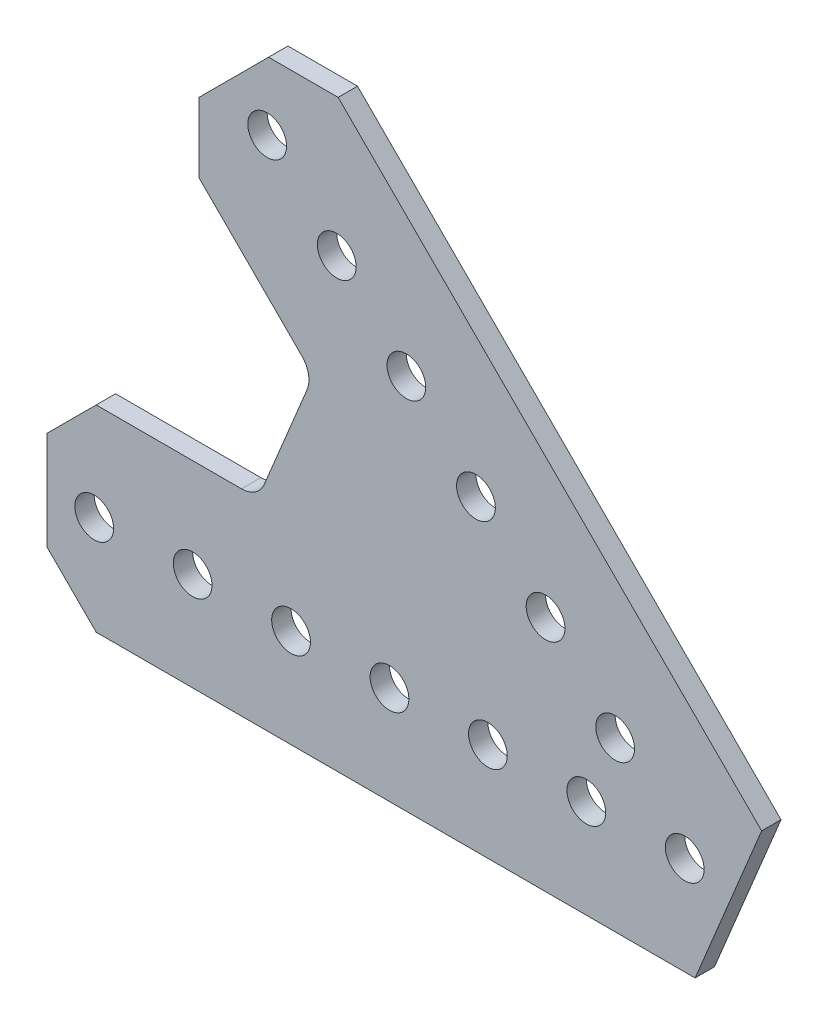
ISO-10303-21;
HEADER;
FILE_DESCRIPTION(('STEP AP214'),'2;1');
FILE_NAME('part.step','',(''),(''),'','','');
FILE_SCHEMA(('AUTOMOTIVE_DESIGN { 1 0 10303 214 1 1 1 1 }'));
ENDSEC;
DATA;
#1=APPLICATION_CONTEXT('core data for automotive mechanical design processes');
#2=APPLICATION_PROTOCOL_DEFINITION('international standard','automotive_design',2000,#1);
#3=PRODUCT_CONTEXT('',#1,'mechanical');
#4=PRODUCT('Part','Part','',(#3));
#5=PRODUCT_RELATED_PRODUCT_CATEGORY('part','',(#4));
#6=PRODUCT_DEFINITION_FORMATION('','',#4);
#7=PRODUCT_DEFINITION_CONTEXT('part definition',#1,'design');
#8=PRODUCT_DEFINITION('design','',#6,#7);
#9=PRODUCT_DEFINITION_SHAPE('','',#8);
#10=(LENGTH_UNIT() NAMED_UNIT(*) SI_UNIT(.MILLI.,.METRE.));
#11=(NAMED_UNIT(*) PLANE_ANGLE_UNIT() SI_UNIT($,.RADIAN.));
#12=(NAMED_UNIT(*) SI_UNIT($,.STERADIAN.) SOLID_ANGLE_UNIT());
#13=UNCERTAINTY_MEASURE_WITH_UNIT(LENGTH_MEASURE(1.E-05),#10,'distance_accuracy_value','');
#14=(GEOMETRIC_REPRESENTATION_CONTEXT(3) GLOBAL_UNCERTAINTY_ASSIGNED_CONTEXT((#13)) GLOBAL_UNIT_ASSIGNED_CONTEXT((#10,
#11,#12)) REPRESENTATION_CONTEXT('',''));
#15=CARTESIAN_POINT('',(0.,0.,0.));
#16=DIRECTION('',(0.,0.,1.));
#17=DIRECTION('',(1.,0.,0.));
#18=AXIS2_PLACEMENT_3D('',#15,#16,#17);
#19=CARTESIAN_POINT('',(9.92618864953346,8.03432359260485,1.25));
#20=DIRECTION('',(0.923879532511288,-0.382683432365087,0.));
#21=DIRECTION('',(0.382683432365087,0.923879532511288,0.));
#22=AXIS2_PLACEMENT_3D('',#19,#20,#21);
#23=PLANE('',#22);
#24=DIRECTION('',(-0.382683432365087,-0.923879532511288,0.));
#25=VECTOR('',#24,1.);
#26=CARTESIAN_POINT('',(9.92618864953346,8.03432359260485,-1.25));
#27=LINE('',#26,#25);
#28=CARTESIAN_POINT('',(9.92618864953346,8.03432359260485,-1.25));
#29=VERTEX_POINT('',#28);
#30=CARTESIAN_POINT('',(1.33775061084416,-12.7,-1.25));
#31=VERTEX_POINT('',#30);
#32=EDGE_CURVE('E184',#29,#31,#27,.T.);
#33=ORIENTED_EDGE('',*,*,#32,.F.);
#34=DIRECTION('',(0.,0.,-1.));
#35=VECTOR('',#34,1.);
#36=CARTESIAN_POINT('',(9.92618864953346,8.03432359260485,1.25));
#37=LINE('',#36,#35);
#38=CARTESIAN_POINT('',(9.92618864953346,8.03432359260485,1.25));
#39=VERTEX_POINT('',#38);
#40=EDGE_CURVE('E11',#39,#29,#37,.T.);
#41=ORIENTED_EDGE('',*,*,#40,.F.);
#42=DIRECTION('',(-0.382683432365087,-0.923879532511288,0.));
#43=VECTOR('',#42,1.);
#44=CARTESIAN_POINT('',(9.92618864953346,8.03432359260485,1.25));
#45=LINE('',#44,#43);
#46=CARTESIAN_POINT('',(1.33775061084416,-12.7,1.25));
#47=VERTEX_POINT('',#46);
#48=EDGE_CURVE('E237',#39,#47,#45,.T.);
#49=ORIENTED_EDGE('',*,*,#48,.T.);
#50=DIRECTION('',(0.,0.,-1.));
#51=VECTOR('',#50,1.);
#52=CARTESIAN_POINT('',(1.33775061084416,-12.7,1.25));
#53=LINE('',#52,#51);
#54=EDGE_CURVE('E48',#47,#31,#53,.T.);
#55=ORIENTED_EDGE('',*,*,#54,.T.);
#56=EDGE_LOOP('',(#33,#41,#49,#55));
#57=FACE_BOUND('',#56,.T.);
#58=ADVANCED_FACE('F45',(#57),#23,.T.);
#59=CARTESIAN_POINT('',(-44.7216754829247,62.6821877250624,1.25));
#60=DIRECTION('',(0.707106781186544,0.707106781186551,0.));
#61=DIRECTION('',(-0.707106781186551,0.707106781186544,0.));
#62=AXIS2_PLACEMENT_3D('',#59,#60,#61);
#63=PLANE('',#62);
#64=DIRECTION('',(0.707106781186551,-0.707106781186544,0.));
#65=VECTOR('',#64,1.);
#66=CARTESIAN_POINT('',(-44.7216754829247,62.6821877250624,-1.25));
#67=LINE('',#66,#65);
#68=CARTESIAN_POINT('',(-44.7216754829247,62.6821877250624,-1.25));
#69=VERTEX_POINT('',#68);
#70=EDGE_CURVE('E234',#69,#29,#67,.T.);
#71=ORIENTED_EDGE('',*,*,#70,.F.);
#72=DIRECTION('',(0.,0.,-1.));
#73=VECTOR('',#72,1.);
#74=CARTESIAN_POINT('',(-44.7216754829247,62.6821877250624,1.25));
#75=LINE('',#74,#73);
#76=CARTESIAN_POINT('',(-44.7216754829247,62.6821877250624,1.25));
#77=VERTEX_POINT('',#76);
#78=EDGE_CURVE('E55',#77,#69,#75,.T.);
#79=ORIENTED_EDGE('',*,*,#78,.F.);
#80=DIRECTION('',(0.707106781186551,-0.707106781186544,0.));
#81=VECTOR('',#80,1.);
#82=CARTESIAN_POINT('',(-44.7216754829247,62.6821877250624,1.25));
#83=LINE('',#82,#81);
#84=EDGE_CURVE('E170',#77,#39,#83,.T.);
#85=ORIENTED_EDGE('',*,*,#84,.T.);
#86=ORIENTED_EDGE('',*,*,#40,.T.);
#87=EDGE_LOOP('',(#71,#79,#85,#86));
#88=FACE_BOUND('',#87,.T.);
#89=ADVANCED_FACE('F273',(#88),#63,.T.);
#90=CARTESIAN_POINT('',(-53.7019316039937,62.6821877250624,1.25));
#91=DIRECTION('',(0.,1.,0.));
#92=DIRECTION('',(0.,0.,1.));
#93=AXIS2_PLACEMENT_3D('',#90,#91,#92);
#94=PLANE('',#93);
#95=DIRECTION('',(1.,0.,0.));
#96=VECTOR('',#95,1.);
#97=CARTESIAN_POINT('',(-53.7019316039937,62.6821877250624,-1.25));
#98=LINE('',#97,#96);
#99=CARTESIAN_POINT('',(-53.7019316039937,62.6821877250624,-1.25));
#100=VERTEX_POINT('',#99);
#101=EDGE_CURVE('E156',#100,#69,#98,.T.);
#102=ORIENTED_EDGE('',*,*,#101,.F.);
#103=DIRECTION('',(0.,0.,-1.));
#104=VECTOR('',#103,1.);
#105=CARTESIAN_POINT('',(-53.7019316039937,62.6821877250624,1.25));
#106=LINE('',#105,#104);
#107=CARTESIAN_POINT('',(-53.7019316039937,62.6821877250624,1.25));
#108=VERTEX_POINT('',#107);
#109=EDGE_CURVE('E151',#108,#100,#106,.T.);
#110=ORIENTED_EDGE('',*,*,#109,.F.);
#111=DIRECTION('',(1.,0.,0.));
#112=VECTOR('',#111,1.);
#113=CARTESIAN_POINT('',(-53.7019316039937,62.6821877250624,1.25));
#114=LINE('',#113,#112);
#115=EDGE_CURVE('E154',#108,#77,#114,.T.);
#116=ORIENTED_EDGE('',*,*,#115,.T.);
#117=ORIENTED_EDGE('',*,*,#78,.T.);
#118=EDGE_LOOP('',(#102,#110,#116,#117));
#119=FACE_BOUND('',#118,.T.);
#120=ADVANCED_FACE('F153',(#119),#94,.T.);
#121=CARTESIAN_POINT('',(-62.6821877250627,53.7019316039929,1.25));
#122=DIRECTION('',(-0.707106781186567,0.707106781186528,0.));
#123=DIRECTION('',(-0.707106781186528,-0.707106781186567,0.));
#124=AXIS2_PLACEMENT_3D('',#121,#122,#123);
#125=PLANE('',#124);
#126=DIRECTION('',(0.707106781186528,0.707106781186567,0.));
#127=VECTOR('',#126,1.);
#128=CARTESIAN_POINT('',(-62.6821877250627,53.7019316039929,-1.25));
#129=LINE('',#128,#127);
#130=CARTESIAN_POINT('',(-62.6821877250627,53.7019316039929,-1.25));
#131=VERTEX_POINT('',#130);
#132=EDGE_CURVE('E229',#131,#100,#129,.T.);
#133=ORIENTED_EDGE('',*,*,#132,.F.);
#134=DIRECTION('',(0.,0.,-1.));
#135=VECTOR('',#134,1.);
#136=CARTESIAN_POINT('',(-62.6821877250627,53.7019316039929,1.25));
#137=LINE('',#136,#135);
#138=CARTESIAN_POINT('',(-62.6821877250627,53.7019316039929,1.25));
#139=VERTEX_POINT('',#138);
#140=EDGE_CURVE('E162',#139,#131,#137,.T.);
#141=ORIENTED_EDGE('',*,*,#140,.F.);
#142=DIRECTION('',(0.707106781186528,0.707106781186567,0.));
#143=VECTOR('',#142,1.);
#144=CARTESIAN_POINT('',(-62.6821877250627,53.7019316039929,1.25));
#145=LINE('',#144,#143);
#146=EDGE_CURVE('E168',#139,#108,#145,.T.);
#147=ORIENTED_EDGE('',*,*,#146,.T.);
#148=ORIENTED_EDGE('',*,*,#109,.T.);
#149=EDGE_LOOP('',(#133,#141,#147,#148));
#150=FACE_BOUND('',#149,.T.);
#151=ADVANCED_FACE('F173',(#150),#125,.T.);
#152=CARTESIAN_POINT('',(-62.6821877250624,44.7216754829236,1.25));
#153=DIRECTION('',(-1.,0.,0.));
#154=DIRECTION('',(0.,-1.,0.));
#155=AXIS2_PLACEMENT_3D('',#152,#153,#154);
#156=PLANE('',#155);
#157=DIRECTION('',(0.,1.,0.));
#158=VECTOR('',#157,1.);
#159=CARTESIAN_POINT('',(-62.6821877250624,44.7216754829236,-1.25));
#160=LINE('',#159,#158);
#161=CARTESIAN_POINT('',(-62.6821877250624,44.7216754829236,-1.25));
#162=VERTEX_POINT('',#161);
#163=EDGE_CURVE('E225',#162,#131,#160,.T.);
#164=ORIENTED_EDGE('',*,*,#163,.F.);
#165=DIRECTION('',(0.,0.,-1.));
#166=VECTOR('',#165,1.);
#167=CARTESIAN_POINT('',(-62.6821877250624,44.7216754829236,1.25));
#168=LINE('',#167,#166);
#169=CARTESIAN_POINT('',(-62.6821877250624,44.7216754829236,1.25));
#170=VERTEX_POINT('',#169);
#171=EDGE_CURVE('E243',#170,#162,#168,.T.);
#172=ORIENTED_EDGE('',*,*,#171,.F.);
#173=DIRECTION('',(0.,1.,0.));
#174=VECTOR('',#173,1.);
#175=CARTESIAN_POINT('',(-62.6821877250624,44.7216754829236,1.25));
#176=LINE('',#175,#174);
#177=EDGE_CURVE('E175',#170,#139,#176,.T.);
#178=ORIENTED_EDGE('',*,*,#177,.T.);
#179=ORIENTED_EDGE('',*,*,#140,.T.);
#180=EDGE_LOOP('',(#164,#172,#178,#179));
#181=FACE_BOUND('',#180,.T.);
#182=ADVANCED_FACE('F286',(#181),#156,.T.);
#183=CARTESIAN_POINT('',(-49.4219589163473,31.4614466742085,1.25));
#184=DIRECTION('',(-0.707106781186545,-0.70710678118655,0.));
#185=DIRECTION('',(0.70710678118655,-0.707106781186545,0.));
#186=AXIS2_PLACEMENT_3D('',#183,#184,#185);
#187=PLANE('',#186);
#188=DIRECTION('',(-0.70710678118655,0.707106781186545,0.));
#189=VECTOR('',#188,1.);
#190=CARTESIAN_POINT('',(-49.4219589163473,31.4614466742085,-1.25));
#191=LINE('',#190,#189);
#192=CARTESIAN_POINT('',(-49.4219589163473,31.4614466742086,-1.25));
#193=VERTEX_POINT('',#192);
#194=EDGE_CURVE('E221',#193,#162,#191,.T.);
#195=ORIENTED_EDGE('',*,*,#194,.F.);
#196=DIRECTION('',(0.,0.,-1.));
#197=VECTOR('',#196,1.);
#198=CARTESIAN_POINT('',(-49.4219589163473,31.4614466742086,1.25));
#199=LINE('',#198,#197);
#200=CARTESIAN_POINT('',(-49.4219589163473,31.4614466742086,1.25));
#201=VERTEX_POINT('',#200);
#202=EDGE_CURVE('E246',#201,#193,#199,.T.);
#203=ORIENTED_EDGE('',*,*,#202,.F.);
#204=DIRECTION('',(-0.70710678118655,0.707106781186545,0.));
#205=VECTOR('',#204,1.);
#206=CARTESIAN_POINT('',(-49.4219589163473,31.4614466742085,1.25));
#207=LINE('',#206,#205);
#208=EDGE_CURVE('E178',#201,#170,#207,.T.);
#209=ORIENTED_EDGE('',*,*,#208,.T.);
#210=ORIENTED_EDGE('',*,*,#171,.T.);
#211=EDGE_LOOP('',(#195,#203,#209,#210));
#212=FACE_BOUND('',#211,.T.);
#213=ADVANCED_FACE('F289',(#212),#187,.T.);
#214=CARTESIAN_POINT('',(-51.6670229466146,29.2163826439413,1.25));
#215=DIRECTION('',(0.,0.,-1.));
#216=DIRECTION('',(-1.,0.,0.));
#217=AXIS2_PLACEMENT_3D('',#214,#215,#216);
#218=CYLINDRICAL_SURFACE('',#217,3.17500000000003);
#219=CARTESIAN_POINT('',(-51.6670229466146,29.2163826439413,-1.25));
#220=DIRECTION('',(0.,0.,1.));
#221=DIRECTION('',(1.,0.,0.));
#222=AXIS2_PLACEMENT_3D('',#219,#220,#221);
#223=CIRCLE('',#222,3.17500000000003);
#224=CARTESIAN_POINT('',(-48.7337054308912,28.0013627461821,-1.25));
#225=VERTEX_POINT('',#224);
#226=EDGE_CURVE('E217',#225,#193,#223,.T.);
#227=ORIENTED_EDGE('',*,*,#226,.F.);
#228=DIRECTION('',(0.,0.,-1.));
#229=VECTOR('',#228,1.);
#230=CARTESIAN_POINT('',(-48.7337054308912,28.0013627461821,1.25));
#231=LINE('',#230,#229);
#232=CARTESIAN_POINT('',(-48.7337054308912,28.0013627461821,1.25));
#233=VERTEX_POINT('',#232);
#234=EDGE_CURVE('E249',#233,#225,#231,.T.);
#235=ORIENTED_EDGE('',*,*,#234,.F.);
#236=CARTESIAN_POINT('',(-51.6670229466146,29.2163826439413,1.25));
#237=DIRECTION('',(0.,0.,1.));
#238=DIRECTION('',(1.,0.,0.));
#239=AXIS2_PLACEMENT_3D('',#236,#237,#238);
#240=CIRCLE('',#239,3.17500000000003);
#241=EDGE_CURVE('E521',#233,#201,#240,.T.);
#242=ORIENTED_EDGE('',*,*,#241,.T.);
#243=ORIENTED_EDGE('',*,*,#202,.T.);
#244=EDGE_LOOP('',(#227,#235,#242,#243));
#245=FACE_BOUND('',#244,.T.);
#246=ADVANCED_FACE('F293',(#245),#218,.F.);
#247=CARTESIAN_POINT('',(-54.2598870628207,14.6599801022408,1.25));
#248=DIRECTION('',(-0.923879532511287,0.38268343236509,0.));
#249=DIRECTION('',(-0.38268343236509,-0.923879532511287,0.));
#250=AXIS2_PLACEMENT_3D('',#247,#248,#249);
#251=PLANE('',#250);
#252=DIRECTION('',(0.38268343236509,0.923879532511287,0.));
#253=VECTOR('',#252,1.);
#254=CARTESIAN_POINT('',(-54.2598870628207,14.6599801022408,-1.25));
#255=LINE('',#254,#253);
#256=CARTESIAN_POINT('',(-54.2598870628207,14.6599801022408,-1.25));
#257=VERTEX_POINT('',#256);
#258=EDGE_CURVE('E213',#257,#225,#255,.T.);
#259=ORIENTED_EDGE('',*,*,#258,.F.);
#260=DIRECTION('',(0.,0.,-1.));
#261=VECTOR('',#260,1.);
#262=CARTESIAN_POINT('',(-54.2598870628207,14.6599801022408,1.25));
#263=LINE('',#262,#261);
#264=CARTESIAN_POINT('',(-54.2598870628207,14.6599801022408,1.25));
#265=VERTEX_POINT('',#264);
#266=EDGE_CURVE('E252',#265,#257,#263,.T.);
#267=ORIENTED_EDGE('',*,*,#266,.F.);
#268=DIRECTION('',(0.38268343236509,0.923879532511287,0.));
#269=VECTOR('',#268,1.);
#270=CARTESIAN_POINT('',(-54.2598870628207,14.6599801022408,1.25));
#271=LINE('',#270,#269);
#272=EDGE_CURVE('E517',#265,#233,#271,.T.);
#273=ORIENTED_EDGE('',*,*,#272,.T.);
#274=ORIENTED_EDGE('',*,*,#234,.T.);
#275=EDGE_LOOP('',(#259,#267,#273,#274));
#276=FACE_BOUND('',#275,.T.);
#277=ADVANCED_FACE('F297',(#276),#251,.T.);
#278=CARTESIAN_POINT('',(-57.193204578544,15.875,1.25));
#279=DIRECTION('',(0.,0.,-1.));
#280=DIRECTION('',(-1.,0.,0.));
#281=AXIS2_PLACEMENT_3D('',#278,#279,#280);
#282=CYLINDRICAL_SURFACE('',#281,3.17499999999998);
#283=CARTESIAN_POINT('',(-57.193204578544,15.875,-1.25));
#284=DIRECTION('',(0.,0.,1.));
#285=DIRECTION('',(1.,0.,0.));
#286=AXIS2_PLACEMENT_3D('',#283,#284,#285);
#287=CIRCLE('',#286,3.17499999999998);
#288=CARTESIAN_POINT('',(-57.193204578544,12.7,-1.25));
#289=VERTEX_POINT('',#288);
#290=EDGE_CURVE('E209',#289,#257,#287,.T.);
#291=ORIENTED_EDGE('',*,*,#290,.F.);
#292=DIRECTION('',(0.,0.,-1.));
#293=VECTOR('',#292,1.);
#294=CARTESIAN_POINT('',(-57.193204578544,12.7,1.25));
#295=LINE('',#294,#293);
#296=CARTESIAN_POINT('',(-57.193204578544,12.7,1.25));
#297=VERTEX_POINT('',#296);
#298=EDGE_CURVE('E255',#297,#289,#295,.T.);
#299=ORIENTED_EDGE('',*,*,#298,.F.);
#300=CARTESIAN_POINT('',(-57.193204578544,15.875,1.25));
#301=DIRECTION('',(0.,0.,1.));
#302=DIRECTION('',(1.,0.,0.));
#303=AXIS2_PLACEMENT_3D('',#300,#301,#302);
#304=CIRCLE('',#303,3.17499999999998);
#305=EDGE_CURVE('E513',#297,#265,#304,.T.);
#306=ORIENTED_EDGE('',*,*,#305,.T.);
#307=ORIENTED_EDGE('',*,*,#266,.T.);
#308=EDGE_LOOP('',(#291,#299,#306,#307));
#309=FACE_BOUND('',#308,.T.);
#310=ADVANCED_FACE('F301',(#309),#282,.F.);
#311=CARTESIAN_POINT('',(-75.946,12.7,1.25));
#312=DIRECTION('',(0.,1.,0.));
#313=DIRECTION('',(0.,0.,1.));
#314=AXIS2_PLACEMENT_3D('',#311,#312,#313);
#315=PLANE('',#314);
#316=DIRECTION('',(1.,0.,0.));
#317=VECTOR('',#316,1.);
#318=CARTESIAN_POINT('',(-75.946,12.7,-1.25));
#319=LINE('',#318,#317);
#320=CARTESIAN_POINT('',(-75.946,12.7,-1.25));
#321=VERTEX_POINT('',#320);
#322=EDGE_CURVE('E205',#321,#289,#319,.T.);
#323=ORIENTED_EDGE('',*,*,#322,.F.);
#324=DIRECTION('',(0.,0.,-1.));
#325=VECTOR('',#324,1.);
#326=CARTESIAN_POINT('',(-75.946,12.7,1.25));
#327=LINE('',#326,#325);
#328=CARTESIAN_POINT('',(-75.946,12.7,1.25));
#329=VERTEX_POINT('',#328);
#330=EDGE_CURVE('E258',#329,#321,#327,.T.);
#331=ORIENTED_EDGE('',*,*,#330,.F.);
#332=DIRECTION('',(1.,0.,0.));
#333=VECTOR('',#332,1.);
#334=CARTESIAN_POINT('',(-75.946,12.7,1.25));
#335=LINE('',#334,#333);
#336=EDGE_CURVE('E509',#329,#297,#335,.T.);
#337=ORIENTED_EDGE('',*,*,#336,.T.);
#338=ORIENTED_EDGE('',*,*,#298,.T.);
#339=EDGE_LOOP('',(#323,#331,#337,#338));
#340=FACE_BOUND('',#339,.T.);
#341=ADVANCED_FACE('F305',(#340),#315,.T.);
#342=CARTESIAN_POINT('',(-82.296,6.35,1.25));
#343=DIRECTION('',(-0.707106781186548,0.707106781186547,0.));
#344=DIRECTION('',(-0.707106781186547,-0.707106781186548,0.));
#345=AXIS2_PLACEMENT_3D('',#342,#343,#344);
#346=PLANE('',#345);
#347=DIRECTION('',(0.707106781186547,0.707106781186548,0.));
#348=VECTOR('',#347,1.);
#349=CARTESIAN_POINT('',(-82.296,6.35,-1.25));
#350=LINE('',#349,#348);
#351=CARTESIAN_POINT('',(-82.296,6.35,-1.25));
#352=VERTEX_POINT('',#351);
#353=EDGE_CURVE('E201',#352,#321,#350,.T.);
#354=ORIENTED_EDGE('',*,*,#353,.F.);
#355=DIRECTION('',(0.,0.,-1.));
#356=VECTOR('',#355,1.);
#357=CARTESIAN_POINT('',(-82.296,6.35,1.25));
#358=LINE('',#357,#356);
#359=CARTESIAN_POINT('',(-82.296,6.35,1.25));
#360=VERTEX_POINT('',#359);
#361=EDGE_CURVE('E261',#360,#352,#358,.T.);
#362=ORIENTED_EDGE('',*,*,#361,.F.);
#363=DIRECTION('',(0.707106781186547,0.707106781186548,0.));
#364=VECTOR('',#363,1.);
#365=CARTESIAN_POINT('',(-82.296,6.35,1.25));
#366=LINE('',#365,#364);
#367=EDGE_CURVE('E505',#360,#329,#366,.T.);
#368=ORIENTED_EDGE('',*,*,#367,.T.);
#369=ORIENTED_EDGE('',*,*,#330,.T.);
#370=EDGE_LOOP('',(#354,#362,#368,#369));
#371=FACE_BOUND('',#370,.T.);
#372=ADVANCED_FACE('F309',(#371),#346,.T.);
#373=CARTESIAN_POINT('',(-82.296,-6.35,1.25));
#374=DIRECTION('',(-1.,0.,0.));
#375=DIRECTION('',(0.,0.,1.));
#376=AXIS2_PLACEMENT_3D('',#373,#374,#375);
#377=PLANE('',#376);
#378=DIRECTION('',(0.,1.,0.));
#379=VECTOR('',#378,1.);
#380=CARTESIAN_POINT('',(-82.296,-6.35,-1.25));
#381=LINE('',#380,#379);
#382=CARTESIAN_POINT('',(-82.296,-6.35,-1.25));
#383=VERTEX_POINT('',#382);
#384=EDGE_CURVE('E197',#383,#352,#381,.T.);
#385=ORIENTED_EDGE('',*,*,#384,.F.);
#386=DIRECTION('',(0.,0.,-1.));
#387=VECTOR('',#386,1.);
#388=CARTESIAN_POINT('',(-82.296,-6.35,1.25));
#389=LINE('',#388,#387);
#390=CARTESIAN_POINT('',(-82.296,-6.35,1.25));
#391=VERTEX_POINT('',#390);
#392=EDGE_CURVE('E264',#391,#383,#389,.T.);
#393=ORIENTED_EDGE('',*,*,#392,.F.);
#394=DIRECTION('',(0.,1.,0.));
#395=VECTOR('',#394,1.);
#396=CARTESIAN_POINT('',(-82.296,-6.35,1.25));
#397=LINE('',#396,#395);
#398=EDGE_CURVE('E501',#391,#360,#397,.T.);
#399=ORIENTED_EDGE('',*,*,#398,.T.);
#400=ORIENTED_EDGE('',*,*,#361,.T.);
#401=EDGE_LOOP('',(#385,#393,#399,#400));
#402=FACE_BOUND('',#401,.T.);
#403=ADVANCED_FACE('F313',(#402),#377,.T.);
#404=CARTESIAN_POINT('',(-75.946,-12.7,1.25));
#405=DIRECTION('',(-0.707106781186548,-0.707106781186547,0.));
#406=DIRECTION('',(0.707106781186547,-0.707106781186548,0.));
#407=AXIS2_PLACEMENT_3D('',#404,#405,#406);
#408=PLANE('',#407);
#409=DIRECTION('',(-0.707106781186547,0.707106781186548,0.));
#410=VECTOR('',#409,1.);
#411=CARTESIAN_POINT('',(-75.946,-12.7,-1.25));
#412=LINE('',#411,#410);
#413=CARTESIAN_POINT('',(-75.946,-12.7,-1.25));
#414=VERTEX_POINT('',#413);
#415=EDGE_CURVE('E193',#414,#383,#412,.T.);
#416=ORIENTED_EDGE('',*,*,#415,.F.);
#417=DIRECTION('',(0.,0.,-1.));
#418=VECTOR('',#417,1.);
#419=CARTESIAN_POINT('',(-75.946,-12.7,1.25));
#420=LINE('',#419,#418);
#421=CARTESIAN_POINT('',(-75.946,-12.7,1.25));
#422=VERTEX_POINT('',#421);
#423=EDGE_CURVE('E266',#422,#414,#420,.T.);
#424=ORIENTED_EDGE('',*,*,#423,.F.);
#425=DIRECTION('',(-0.707106781186547,0.707106781186548,0.));
#426=VECTOR('',#425,1.);
#427=CARTESIAN_POINT('',(-75.946,-12.7,1.25));
#428=LINE('',#427,#426);
#429=EDGE_CURVE('E497',#422,#391,#428,.T.);
#430=ORIENTED_EDGE('',*,*,#429,.T.);
#431=ORIENTED_EDGE('',*,*,#392,.T.);
#432=EDGE_LOOP('',(#416,#424,#430,#431));
#433=FACE_BOUND('',#432,.T.);
#434=ADVANCED_FACE('F317',(#433),#408,.T.);
#435=CARTESIAN_POINT('',(1.33775061084416,-12.7,1.25));
#436=DIRECTION('',(0.,-1.,0.));
#437=DIRECTION('',(0.,0.,-1.));
#438=AXIS2_PLACEMENT_3D('',#435,#436,#437);
#439=PLANE('',#438);
#440=DIRECTION('',(-1.,0.,0.));
#441=VECTOR('',#440,1.);
#442=CARTESIAN_POINT('',(1.33775061084416,-12.7,-1.25));
#443=LINE('',#442,#441);
#444=EDGE_CURVE('E188',#31,#414,#443,.T.);
#445=ORIENTED_EDGE('',*,*,#444,.F.);
#446=ORIENTED_EDGE('',*,*,#54,.F.);
#447=DIRECTION('',(-1.,0.,0.));
#448=VECTOR('',#447,1.);
#449=CARTESIAN_POINT('',(1.33775061084416,-12.7,1.25));
#450=LINE('',#449,#448);
#451=EDGE_CURVE('E494',#47,#422,#450,.T.);
#452=ORIENTED_EDGE('',*,*,#451,.T.);
#453=ORIENTED_EDGE('',*,*,#423,.T.);
#454=EDGE_LOOP('',(#445,#446,#452,#453));
#455=FACE_BOUND('',#454,.T.);
#456=ADVANCED_FACE('F270',(#455),#439,.T.);
#457=CARTESIAN_POINT('',(-57.193204578544,15.875,1.25));
#458=DIRECTION('',(0.,0.,1.));
#459=DIRECTION('',(1.,0.,0.));
#460=AXIS2_PLACEMENT_3D('',#457,#458,#459);
#461=PLANE('',#460);
#462=CARTESIAN_POINT('',(-8.98025612106892,8.98025612106939,1.25));
#463=DIRECTION('',(0.,0.,-1.));
#464=DIRECTION('',(1.,0.,0.));
#465=AXIS2_PLACEMENT_3D('',#462,#463,#464);
#466=CIRCLE('',#465,2.5);
#467=CARTESIAN_POINT('',(-6.48025612106892,8.98025612106939,1.25));
#468=VERTEX_POINT('',#467);
#469=EDGE_CURVE('E388',#468,#468,#466,.T.);
#470=ORIENTED_EDGE('',*,*,#469,.T.);
#471=EDGE_LOOP('',(#470));
#472=FACE_BOUND('',#471,.T.);
#473=CARTESIAN_POINT('',(-17.9605122421381,17.9605122421385,1.25));
#474=DIRECTION('',(0.,0.,-1.));
#475=DIRECTION('',(1.,0.,0.));
#476=AXIS2_PLACEMENT_3D('',#473,#474,#475);
#477=CIRCLE('',#476,2.5);
#478=CARTESIAN_POINT('',(-15.4605122421381,17.9605122421385,1.25));
#479=VERTEX_POINT('',#478);
#480=EDGE_CURVE('E398',#479,#479,#477,.T.);
#481=ORIENTED_EDGE('',*,*,#480,.T.);
#482=EDGE_LOOP('',(#481));
#483=FACE_BOUND('',#482,.T.);
#484=CARTESIAN_POINT('',(-26.9407683632073,26.9407683632076,1.25));
#485=DIRECTION('',(0.,0.,-1.));
#486=DIRECTION('',(1.,0.,0.));
#487=AXIS2_PLACEMENT_3D('',#484,#485,#486);
#488=CIRCLE('',#487,2.5);
#489=CARTESIAN_POINT('',(-24.4407683632073,26.9407683632076,1.25));
#490=VERTEX_POINT('',#489);
#491=EDGE_CURVE('E406',#490,#490,#488,.T.);
#492=ORIENTED_EDGE('',*,*,#491,.T.);
#493=EDGE_LOOP('',(#492));
#494=FACE_BOUND('',#493,.T.);
#495=CARTESIAN_POINT('',(-35.9210244842765,35.9210244842767,1.25));
#496=DIRECTION('',(0.,0.,-1.));
#497=DIRECTION('',(1.,0.,0.));
#498=AXIS2_PLACEMENT_3D('',#495,#496,#497);
#499=CIRCLE('',#498,2.5);
#500=CARTESIAN_POINT('',(-33.4210244842765,35.9210244842767,1.25));
#501=VERTEX_POINT('',#500);
#502=EDGE_CURVE('E414',#501,#501,#499,.T.);
#503=ORIENTED_EDGE('',*,*,#502,.T.);
#504=EDGE_LOOP('',(#503));
#505=FACE_BOUND('',#504,.T.);
#506=CARTESIAN_POINT('',(-44.9012806053457,44.9012806053458,1.25));
#507=DIRECTION('',(0.,0.,-1.));
#508=DIRECTION('',(1.,0.,0.));
#509=AXIS2_PLACEMENT_3D('',#506,#507,#508);
#510=CIRCLE('',#509,2.5);
#511=CARTESIAN_POINT('',(-42.4012806053457,44.9012806053458,1.25));
#512=VERTEX_POINT('',#511);
#513=EDGE_CURVE('E422',#512,#512,#510,.T.);
#514=ORIENTED_EDGE('',*,*,#513,.T.);
#515=EDGE_LOOP('',(#514));
#516=FACE_BOUND('',#515,.T.);
#517=CARTESIAN_POINT('',(-53.8815367264149,53.8815367264149,1.25));
#518=DIRECTION('',(0.,0.,-1.));
#519=DIRECTION('',(1.,0.,0.));
#520=AXIS2_PLACEMENT_3D('',#517,#518,#519);
#521=CIRCLE('',#520,2.5);
#522=CARTESIAN_POINT('',(-51.3815367264149,53.8815367264149,1.25));
#523=VERTEX_POINT('',#522);
#524=EDGE_CURVE('E430',#523,#523,#521,.T.);
#525=ORIENTED_EDGE('',*,*,#524,.T.);
#526=EDGE_LOOP('',(#525));
#527=FACE_BOUND('',#526,.T.);
#528=CARTESIAN_POINT('',(-63.5,0.,1.25));
#529=DIRECTION('',(0.,0.,-1.));
#530=DIRECTION('',(1.,0.,0.));
#531=AXIS2_PLACEMENT_3D('',#528,#529,#530);
#532=CIRCLE('',#531,2.5);
#533=CARTESIAN_POINT('',(-61.,0.,1.25));
#534=VERTEX_POINT('',#533);
#535=EDGE_CURVE('E438',#534,#534,#532,.T.);
#536=ORIENTED_EDGE('',*,*,#535,.T.);
#537=EDGE_LOOP('',(#536));
#538=FACE_BOUND('',#537,.T.);
#539=CARTESIAN_POINT('',(-76.2,0.,1.25));
#540=DIRECTION('',(0.,0.,-1.));
#541=DIRECTION('',(1.,0.,0.));
#542=AXIS2_PLACEMENT_3D('',#539,#540,#541);
#543=CIRCLE('',#542,2.5);
#544=CARTESIAN_POINT('',(-73.7,0.,1.25));
#545=VERTEX_POINT('',#544);
#546=EDGE_CURVE('E446',#545,#545,#543,.T.);
#547=ORIENTED_EDGE('',*,*,#546,.T.);
#548=EDGE_LOOP('',(#547));
#549=FACE_BOUND('',#548,.T.);
#550=CARTESIAN_POINT('',(0.,0.,1.25));
#551=DIRECTION('',(0.,0.,-1.));
#552=DIRECTION('',(1.,0.,0.));
#553=AXIS2_PLACEMENT_3D('',#550,#551,#552);
#554=CIRCLE('',#553,2.5);
#555=CARTESIAN_POINT('',(2.5,0.,1.25));
#556=VERTEX_POINT('',#555);
#557=EDGE_CURVE('E454',#556,#556,#554,.T.);
#558=ORIENTED_EDGE('',*,*,#557,.T.);
#559=EDGE_LOOP('',(#558));
#560=FACE_BOUND('',#559,.T.);
#561=CARTESIAN_POINT('',(-50.8,0.,1.25));
#562=DIRECTION('',(0.,0.,-1.));
#563=DIRECTION('',(1.,0.,0.));
#564=AXIS2_PLACEMENT_3D('',#561,#562,#563);
#565=CIRCLE('',#564,2.5);
#566=CARTESIAN_POINT('',(-48.3,0.,1.25));
#567=VERTEX_POINT('',#566);
#568=EDGE_CURVE('E462',#567,#567,#565,.T.);
#569=ORIENTED_EDGE('',*,*,#568,.T.);
#570=EDGE_LOOP('',(#569));
#571=FACE_BOUND('',#570,.T.);
#572=CARTESIAN_POINT('',(-38.1,0.,1.25));
#573=DIRECTION('',(0.,0.,-1.));
#574=DIRECTION('',(1.,0.,0.));
#575=AXIS2_PLACEMENT_3D('',#572,#573,#574);
#576=CIRCLE('',#575,2.5);
#577=CARTESIAN_POINT('',(-35.6,0.,1.25));
#578=VERTEX_POINT('',#577);
#579=EDGE_CURVE('E470',#578,#578,#576,.T.);
#580=ORIENTED_EDGE('',*,*,#579,.T.);
#581=EDGE_LOOP('',(#580));
#582=FACE_BOUND('',#581,.T.);
#583=CARTESIAN_POINT('',(-25.4,0.,1.25));
#584=DIRECTION('',(0.,0.,-1.));
#585=DIRECTION('',(1.,0.,0.));
#586=AXIS2_PLACEMENT_3D('',#583,#584,#585);
#587=CIRCLE('',#586,2.5);
#588=CARTESIAN_POINT('',(-22.9,0.,1.25));
#589=VERTEX_POINT('',#588);
#590=EDGE_CURVE('E478',#589,#589,#587,.T.);
#591=ORIENTED_EDGE('',*,*,#590,.T.);
#592=EDGE_LOOP('',(#591));
#593=FACE_BOUND('',#592,.T.);
#594=CARTESIAN_POINT('',(-12.7,0.,1.25));
#595=DIRECTION('',(0.,0.,-1.));
#596=DIRECTION('',(1.,0.,0.));
#597=AXIS2_PLACEMENT_3D('',#594,#595,#596);
#598=CIRCLE('',#597,2.5);
#599=CARTESIAN_POINT('',(-10.2,0.,1.25));
#600=VERTEX_POINT('',#599);
#601=EDGE_CURVE('E189',#600,#600,#598,.T.);
#602=ORIENTED_EDGE('',*,*,#601,.T.);
#603=EDGE_LOOP('',(#602));
#604=FACE_BOUND('',#603,.T.);
#605=ORIENTED_EDGE('',*,*,#48,.F.);
#606=ORIENTED_EDGE('',*,*,#84,.F.);
#607=ORIENTED_EDGE('',*,*,#115,.F.);
#608=ORIENTED_EDGE('',*,*,#146,.F.);
#609=ORIENTED_EDGE('',*,*,#177,.F.);
#610=ORIENTED_EDGE('',*,*,#208,.F.);
#611=ORIENTED_EDGE('',*,*,#241,.F.);
#612=ORIENTED_EDGE('',*,*,#272,.F.);
#613=ORIENTED_EDGE('',*,*,#305,.F.);
#614=ORIENTED_EDGE('',*,*,#336,.F.);
#615=ORIENTED_EDGE('',*,*,#367,.F.);
#616=ORIENTED_EDGE('',*,*,#398,.F.);
#617=ORIENTED_EDGE('',*,*,#429,.F.);
#618=ORIENTED_EDGE('',*,*,#451,.F.);
#619=EDGE_LOOP('',(#605,#606,#607,#608,#609,#610,#611,#612,#613,#614,#615,#616,#617,#618));
#620=FACE_BOUND('',#619,.T.);
#621=ADVANCED_FACE('F166',(#472,#483,#494,#505,#516,#527,#538,#549,#560,#571,#582,#593,#604,
#620),#461,.T.);
#622=CARTESIAN_POINT('',(-57.193204578544,15.875,-1.25));
#623=DIRECTION('',(0.,0.,1.));
#624=DIRECTION('',(1.,0.,0.));
#625=AXIS2_PLACEMENT_3D('',#622,#623,#624);
#626=PLANE('',#625);
#627=CARTESIAN_POINT('',(-8.98025612106892,8.98025612106939,-1.25));
#628=DIRECTION('',(0.,0.,-1.));
#629=DIRECTION('',(1.,0.,0.));
#630=AXIS2_PLACEMENT_3D('',#627,#628,#629);
#631=CIRCLE('',#630,2.5);
#632=CARTESIAN_POINT('',(-6.48025612106892,8.98025612106939,-1.25));
#633=VERTEX_POINT('',#632);
#634=EDGE_CURVE('E391',#633,#633,#631,.T.);
#635=ORIENTED_EDGE('',*,*,#634,.F.);
#636=EDGE_LOOP('',(#635));
#637=FACE_BOUND('',#636,.T.);
#638=CARTESIAN_POINT('',(-17.9605122421381,17.9605122421385,-1.25));
#639=DIRECTION('',(0.,0.,-1.));
#640=DIRECTION('',(1.,0.,0.));
#641=AXIS2_PLACEMENT_3D('',#638,#639,#640);
#642=CIRCLE('',#641,2.5);
#643=CARTESIAN_POINT('',(-15.4605122421381,17.9605122421385,-1.25));
#644=VERTEX_POINT('',#643);
#645=EDGE_CURVE('E395',#644,#644,#642,.T.);
#646=ORIENTED_EDGE('',*,*,#645,.F.);
#647=EDGE_LOOP('',(#646));
#648=FACE_BOUND('',#647,.T.);
#649=CARTESIAN_POINT('',(-26.9407683632073,26.9407683632076,-1.25));
#650=DIRECTION('',(0.,0.,-1.));
#651=DIRECTION('',(1.,0.,0.));
#652=AXIS2_PLACEMENT_3D('',#649,#650,#651);
#653=CIRCLE('',#652,2.5);
#654=CARTESIAN_POINT('',(-24.4407683632073,26.9407683632076,-1.25));
#655=VERTEX_POINT('',#654);
#656=EDGE_CURVE('E402',#655,#655,#653,.T.);
#657=ORIENTED_EDGE('',*,*,#656,.F.);
#658=EDGE_LOOP('',(#657));
#659=FACE_BOUND('',#658,.T.);
#660=CARTESIAN_POINT('',(-35.9210244842765,35.9210244842767,-1.25));
#661=DIRECTION('',(0.,0.,-1.));
#662=DIRECTION('',(1.,0.,0.));
#663=AXIS2_PLACEMENT_3D('',#660,#661,#662);
#664=CIRCLE('',#663,2.5);
#665=CARTESIAN_POINT('',(-33.4210244842765,35.9210244842767,-1.25));
#666=VERTEX_POINT('',#665);
#667=EDGE_CURVE('E410',#666,#666,#664,.T.);
#668=ORIENTED_EDGE('',*,*,#667,.F.);
#669=EDGE_LOOP('',(#668));
#670=FACE_BOUND('',#669,.T.);
#671=CARTESIAN_POINT('',(-44.9012806053457,44.9012806053458,-1.25));
#672=DIRECTION('',(0.,0.,-1.));
#673=DIRECTION('',(1.,0.,0.));
#674=AXIS2_PLACEMENT_3D('',#671,#672,#673);
#675=CIRCLE('',#674,2.5);
#676=CARTESIAN_POINT('',(-42.4012806053457,44.9012806053458,-1.25));
#677=VERTEX_POINT('',#676);
#678=EDGE_CURVE('E418',#677,#677,#675,.T.);
#679=ORIENTED_EDGE('',*,*,#678,.F.);
#680=EDGE_LOOP('',(#679));
#681=FACE_BOUND('',#680,.T.);
#682=CARTESIAN_POINT('',(-53.8815367264149,53.8815367264149,-1.25));
#683=DIRECTION('',(0.,0.,-1.));
#684=DIRECTION('',(1.,0.,0.));
#685=AXIS2_PLACEMENT_3D('',#682,#683,#684);
#686=CIRCLE('',#685,2.5);
#687=CARTESIAN_POINT('',(-51.3815367264149,53.8815367264149,-1.25));
#688=VERTEX_POINT('',#687);
#689=EDGE_CURVE('E426',#688,#688,#686,.T.);
#690=ORIENTED_EDGE('',*,*,#689,.F.);
#691=EDGE_LOOP('',(#690));
#692=FACE_BOUND('',#691,.T.);
#693=CARTESIAN_POINT('',(-63.5,0.,-1.25));
#694=DIRECTION('',(0.,0.,-1.));
#695=DIRECTION('',(1.,0.,0.));
#696=AXIS2_PLACEMENT_3D('',#693,#694,#695);
#697=CIRCLE('',#696,2.5);
#698=CARTESIAN_POINT('',(-61.,0.,-1.25));
#699=VERTEX_POINT('',#698);
#700=EDGE_CURVE('E434',#699,#699,#697,.T.);
#701=ORIENTED_EDGE('',*,*,#700,.F.);
#702=EDGE_LOOP('',(#701));
#703=FACE_BOUND('',#702,.T.);
#704=CARTESIAN_POINT('',(-76.2,0.,-1.25));
#705=DIRECTION('',(0.,0.,-1.));
#706=DIRECTION('',(1.,0.,0.));
#707=AXIS2_PLACEMENT_3D('',#704,#705,#706);
#708=CIRCLE('',#707,2.5);
#709=CARTESIAN_POINT('',(-73.7,0.,-1.25));
#710=VERTEX_POINT('',#709);
#711=EDGE_CURVE('E442',#710,#710,#708,.T.);
#712=ORIENTED_EDGE('',*,*,#711,.F.);
#713=EDGE_LOOP('',(#712));
#714=FACE_BOUND('',#713,.T.);
#715=CARTESIAN_POINT('',(0.,0.,-1.25));
#716=DIRECTION('',(0.,0.,-1.));
#717=DIRECTION('',(1.,0.,0.));
#718=AXIS2_PLACEMENT_3D('',#715,#716,#717);
#719=CIRCLE('',#718,2.5);
#720=CARTESIAN_POINT('',(2.5,0.,-1.25));
#721=VERTEX_POINT('',#720);
#722=EDGE_CURVE('E450',#721,#721,#719,.T.);
#723=ORIENTED_EDGE('',*,*,#722,.F.);
#724=EDGE_LOOP('',(#723));
#725=FACE_BOUND('',#724,.T.);
#726=CARTESIAN_POINT('',(-50.8,0.,-1.25));
#727=DIRECTION('',(0.,0.,-1.));
#728=DIRECTION('',(1.,0.,0.));
#729=AXIS2_PLACEMENT_3D('',#726,#727,#728);
#730=CIRCLE('',#729,2.5);
#731=CARTESIAN_POINT('',(-48.3,0.,-1.25));
#732=VERTEX_POINT('',#731);
#733=EDGE_CURVE('E458',#732,#732,#730,.T.);
#734=ORIENTED_EDGE('',*,*,#733,.F.);
#735=EDGE_LOOP('',(#734));
#736=FACE_BOUND('',#735,.T.);
#737=CARTESIAN_POINT('',(-38.1,0.,-1.25));
#738=DIRECTION('',(0.,0.,-1.));
#739=DIRECTION('',(1.,0.,0.));
#740=AXIS2_PLACEMENT_3D('',#737,#738,#739);
#741=CIRCLE('',#740,2.5);
#742=CARTESIAN_POINT('',(-35.6,0.,-1.25));
#743=VERTEX_POINT('',#742);
#744=EDGE_CURVE('E466',#743,#743,#741,.T.);
#745=ORIENTED_EDGE('',*,*,#744,.F.);
#746=EDGE_LOOP('',(#745));
#747=FACE_BOUND('',#746,.T.);
#748=CARTESIAN_POINT('',(-25.4,0.,-1.25));
#749=DIRECTION('',(0.,0.,-1.));
#750=DIRECTION('',(1.,0.,0.));
#751=AXIS2_PLACEMENT_3D('',#748,#749,#750);
#752=CIRCLE('',#751,2.5);
#753=CARTESIAN_POINT('',(-22.9,0.,-1.25));
#754=VERTEX_POINT('',#753);
#755=EDGE_CURVE('E474',#754,#754,#752,.T.);
#756=ORIENTED_EDGE('',*,*,#755,.F.);
#757=EDGE_LOOP('',(#756));
#758=FACE_BOUND('',#757,.T.);
#759=CARTESIAN_POINT('',(-12.7,0.,-1.25));
#760=DIRECTION('',(0.,0.,-1.));
#761=DIRECTION('',(1.,0.,0.));
#762=AXIS2_PLACEMENT_3D('',#759,#760,#761);
#763=CIRCLE('',#762,2.5);
#764=CARTESIAN_POINT('',(-10.2,0.,-1.25));
#765=VERTEX_POINT('',#764);
#766=EDGE_CURVE('E482',#765,#765,#763,.T.);
#767=ORIENTED_EDGE('',*,*,#766,.F.);
#768=EDGE_LOOP('',(#767));
#769=FACE_BOUND('',#768,.T.);
#770=ORIENTED_EDGE('',*,*,#32,.T.);
#771=ORIENTED_EDGE('',*,*,#444,.T.);
#772=ORIENTED_EDGE('',*,*,#415,.T.);
#773=ORIENTED_EDGE('',*,*,#384,.T.);
#774=ORIENTED_EDGE('',*,*,#353,.T.);
#775=ORIENTED_EDGE('',*,*,#322,.T.);
#776=ORIENTED_EDGE('',*,*,#290,.T.);
#777=ORIENTED_EDGE('',*,*,#258,.T.);
#778=ORIENTED_EDGE('',*,*,#226,.T.);
#779=ORIENTED_EDGE('',*,*,#194,.T.);
#780=ORIENTED_EDGE('',*,*,#163,.T.);
#781=ORIENTED_EDGE('',*,*,#132,.T.);
#782=ORIENTED_EDGE('',*,*,#101,.T.);
#783=ORIENTED_EDGE('',*,*,#70,.T.);
#784=EDGE_LOOP('',(#770,#771,#772,#773,#774,#775,#776,#777,#778,#779,#780,#781,#782,#783));
#785=FACE_BOUND('',#784,.T.);
#786=ADVANCED_FACE('F272',(#637,#648,#659,#670,#681,#692,#703,#714,#725,#736,#747,#758,#769,
#785),#626,.F.);
#787=CARTESIAN_POINT('',(-12.7,0.,1.25));
#788=DIRECTION('',(0.,0.,-1.));
#789=DIRECTION('',(-1.,0.,0.));
#790=AXIS2_PLACEMENT_3D('',#787,#788,#789);
#791=CYLINDRICAL_SURFACE('',#790,2.5);
#792=ORIENTED_EDGE('',*,*,#601,.F.);
#793=EDGE_LOOP('',(#792));
#794=FACE_BOUND('',#793,.T.);
#795=ORIENTED_EDGE('',*,*,#766,.T.);
#796=EDGE_LOOP('',(#795));
#797=FACE_BOUND('',#796,.T.);
#798=ADVANCED_FACE('F329',(#794,#797),#791,.F.);
#799=CARTESIAN_POINT('',(-25.4,0.,1.25));
#800=DIRECTION('',(0.,0.,-1.));
#801=DIRECTION('',(-1.,0.,0.));
#802=AXIS2_PLACEMENT_3D('',#799,#800,#801);
#803=CYLINDRICAL_SURFACE('',#802,2.5);
#804=ORIENTED_EDGE('',*,*,#590,.F.);
#805=EDGE_LOOP('',(#804));
#806=FACE_BOUND('',#805,.T.);
#807=ORIENTED_EDGE('',*,*,#755,.T.);
#808=EDGE_LOOP('',(#807));
#809=FACE_BOUND('',#808,.T.);
#810=ADVANCED_FACE('F336',(#806,#809),#803,.F.);
#811=CARTESIAN_POINT('',(-38.1,0.,1.25));
#812=DIRECTION('',(0.,0.,-1.));
#813=DIRECTION('',(-1.,0.,0.));
#814=AXIS2_PLACEMENT_3D('',#811,#812,#813);
#815=CYLINDRICAL_SURFACE('',#814,2.5);
#816=ORIENTED_EDGE('',*,*,#579,.F.);
#817=EDGE_LOOP('',(#816));
#818=FACE_BOUND('',#817,.T.);
#819=ORIENTED_EDGE('',*,*,#744,.T.);
#820=EDGE_LOOP('',(#819));
#821=FACE_BOUND('',#820,.T.);
#822=ADVANCED_FACE('F340',(#818,#821),#815,.F.);
#823=CARTESIAN_POINT('',(-50.8,0.,1.25));
#824=DIRECTION('',(0.,0.,-1.));
#825=DIRECTION('',(-1.,0.,0.));
#826=AXIS2_PLACEMENT_3D('',#823,#824,#825);
#827=CYLINDRICAL_SURFACE('',#826,2.5);
#828=ORIENTED_EDGE('',*,*,#568,.F.);
#829=EDGE_LOOP('',(#828));
#830=FACE_BOUND('',#829,.T.);
#831=ORIENTED_EDGE('',*,*,#733,.T.);
#832=EDGE_LOOP('',(#831));
#833=FACE_BOUND('',#832,.T.);
#834=ADVANCED_FACE('F344',(#830,#833),#827,.F.);
#835=CARTESIAN_POINT('',(0.,0.,1.25));
#836=DIRECTION('',(0.,0.,-1.));
#837=DIRECTION('',(-1.,0.,0.));
#838=AXIS2_PLACEMENT_3D('',#835,#836,#837);
#839=CYLINDRICAL_SURFACE('',#838,2.5);
#840=ORIENTED_EDGE('',*,*,#557,.F.);
#841=EDGE_LOOP('',(#840));
#842=FACE_BOUND('',#841,.T.);
#843=ORIENTED_EDGE('',*,*,#722,.T.);
#844=EDGE_LOOP('',(#843));
#845=FACE_BOUND('',#844,.T.);
#846=ADVANCED_FACE('F348',(#842,#845),#839,.F.);
#847=CARTESIAN_POINT('',(-76.2,0.,1.25));
#848=DIRECTION('',(0.,0.,-1.));
#849=DIRECTION('',(-1.,0.,0.));
#850=AXIS2_PLACEMENT_3D('',#847,#848,#849);
#851=CYLINDRICAL_SURFACE('',#850,2.5);
#852=ORIENTED_EDGE('',*,*,#546,.F.);
#853=EDGE_LOOP('',(#852));
#854=FACE_BOUND('',#853,.T.);
#855=ORIENTED_EDGE('',*,*,#711,.T.);
#856=EDGE_LOOP('',(#855));
#857=FACE_BOUND('',#856,.T.);
#858=ADVANCED_FACE('F352',(#854,#857),#851,.F.);
#859=CARTESIAN_POINT('',(-63.5,0.,1.25));
#860=DIRECTION('',(0.,0.,-1.));
#861=DIRECTION('',(-1.,0.,0.));
#862=AXIS2_PLACEMENT_3D('',#859,#860,#861);
#863=CYLINDRICAL_SURFACE('',#862,2.5);
#864=ORIENTED_EDGE('',*,*,#535,.F.);
#865=EDGE_LOOP('',(#864));
#866=FACE_BOUND('',#865,.T.);
#867=ORIENTED_EDGE('',*,*,#700,.T.);
#868=EDGE_LOOP('',(#867));
#869=FACE_BOUND('',#868,.T.);
#870=ADVANCED_FACE('F356',(#866,#869),#863,.F.);
#871=CARTESIAN_POINT('',(-53.8815367264149,53.8815367264149,1.25));
#872=DIRECTION('',(0.,0.,-1.));
#873=DIRECTION('',(-1.,0.,0.));
#874=AXIS2_PLACEMENT_3D('',#871,#872,#873);
#875=CYLINDRICAL_SURFACE('',#874,2.5);
#876=ORIENTED_EDGE('',*,*,#524,.F.);
#877=EDGE_LOOP('',(#876));
#878=FACE_BOUND('',#877,.T.);
#879=ORIENTED_EDGE('',*,*,#689,.T.);
#880=EDGE_LOOP('',(#879));
#881=FACE_BOUND('',#880,.T.);
#882=ADVANCED_FACE('F360',(#878,#881),#875,.F.);
#883=CARTESIAN_POINT('',(-44.9012806053457,44.9012806053458,1.25));
#884=DIRECTION('',(0.,0.,-1.));
#885=DIRECTION('',(-1.,0.,0.));
#886=AXIS2_PLACEMENT_3D('',#883,#884,#885);
#887=CYLINDRICAL_SURFACE('',#886,2.5);
#888=ORIENTED_EDGE('',*,*,#513,.F.);
#889=EDGE_LOOP('',(#888));
#890=FACE_BOUND('',#889,.T.);
#891=ORIENTED_EDGE('',*,*,#678,.T.);
#892=EDGE_LOOP('',(#891));
#893=FACE_BOUND('',#892,.T.);
#894=ADVANCED_FACE('F364',(#890,#893),#887,.F.);
#895=CARTESIAN_POINT('',(-35.9210244842765,35.9210244842767,1.25));
#896=DIRECTION('',(0.,0.,-1.));
#897=DIRECTION('',(-1.,0.,0.));
#898=AXIS2_PLACEMENT_3D('',#895,#896,#897);
#899=CYLINDRICAL_SURFACE('',#898,2.5);
#900=ORIENTED_EDGE('',*,*,#502,.F.);
#901=EDGE_LOOP('',(#900));
#902=FACE_BOUND('',#901,.T.);
#903=ORIENTED_EDGE('',*,*,#667,.T.);
#904=EDGE_LOOP('',(#903));
#905=FACE_BOUND('',#904,.T.);
#906=ADVANCED_FACE('F368',(#902,#905),#899,.F.);
#907=CARTESIAN_POINT('',(-26.9407683632073,26.9407683632076,1.25));
#908=DIRECTION('',(0.,0.,-1.));
#909=DIRECTION('',(-1.,0.,0.));
#910=AXIS2_PLACEMENT_3D('',#907,#908,#909);
#911=CYLINDRICAL_SURFACE('',#910,2.5);
#912=ORIENTED_EDGE('',*,*,#491,.F.);
#913=EDGE_LOOP('',(#912));
#914=FACE_BOUND('',#913,.T.);
#915=ORIENTED_EDGE('',*,*,#656,.T.);
#916=EDGE_LOOP('',(#915));
#917=FACE_BOUND('',#916,.T.);
#918=ADVANCED_FACE('F372',(#914,#917),#911,.F.);
#919=CARTESIAN_POINT('',(-17.9605122421381,17.9605122421385,1.25));
#920=DIRECTION('',(0.,0.,-1.));
#921=DIRECTION('',(-1.,0.,0.));
#922=AXIS2_PLACEMENT_3D('',#919,#920,#921);
#923=CYLINDRICAL_SURFACE('',#922,2.5);
#924=ORIENTED_EDGE('',*,*,#480,.F.);
#925=EDGE_LOOP('',(#924));
#926=FACE_BOUND('',#925,.T.);
#927=ORIENTED_EDGE('',*,*,#645,.T.);
#928=EDGE_LOOP('',(#927));
#929=FACE_BOUND('',#928,.T.);
#930=ADVANCED_FACE('F376',(#926,#929),#923,.F.);
#931=CARTESIAN_POINT('',(-8.98025612106892,8.98025612106939,1.25));
#932=DIRECTION('',(0.,0.,-1.));
#933=DIRECTION('',(-1.,0.,0.));
#934=AXIS2_PLACEMENT_3D('',#931,#932,#933);
#935=CYLINDRICAL_SURFACE('',#934,2.5);
#936=ORIENTED_EDGE('',*,*,#469,.F.);
#937=EDGE_LOOP('',(#936));
#938=FACE_BOUND('',#937,.T.);
#939=ORIENTED_EDGE('',*,*,#634,.T.);
#940=EDGE_LOOP('',(#939));
#941=FACE_BOUND('',#940,.T.);
#942=ADVANCED_FACE('F380',(#938,#941),#935,.F.);
#943=CLOSED_SHELL('',(#58,#89,#120,#151,#182,#213,#246,#277,#310,#341,#372,#403,#434,#456,#621,
#786,#798,#810,#822,#834,#846,#858,#870,#882,#894,#906,#918,#930,#942));
#944=MANIFOLD_SOLID_BREP('B2',#943);
#945=ADVANCED_BREP_SHAPE_REPRESENTATION('',(#18,#944),#14);
#946=SHAPE_DEFINITION_REPRESENTATION(#9,#945);
ENDSEC;
END-ISO-10303-21;
